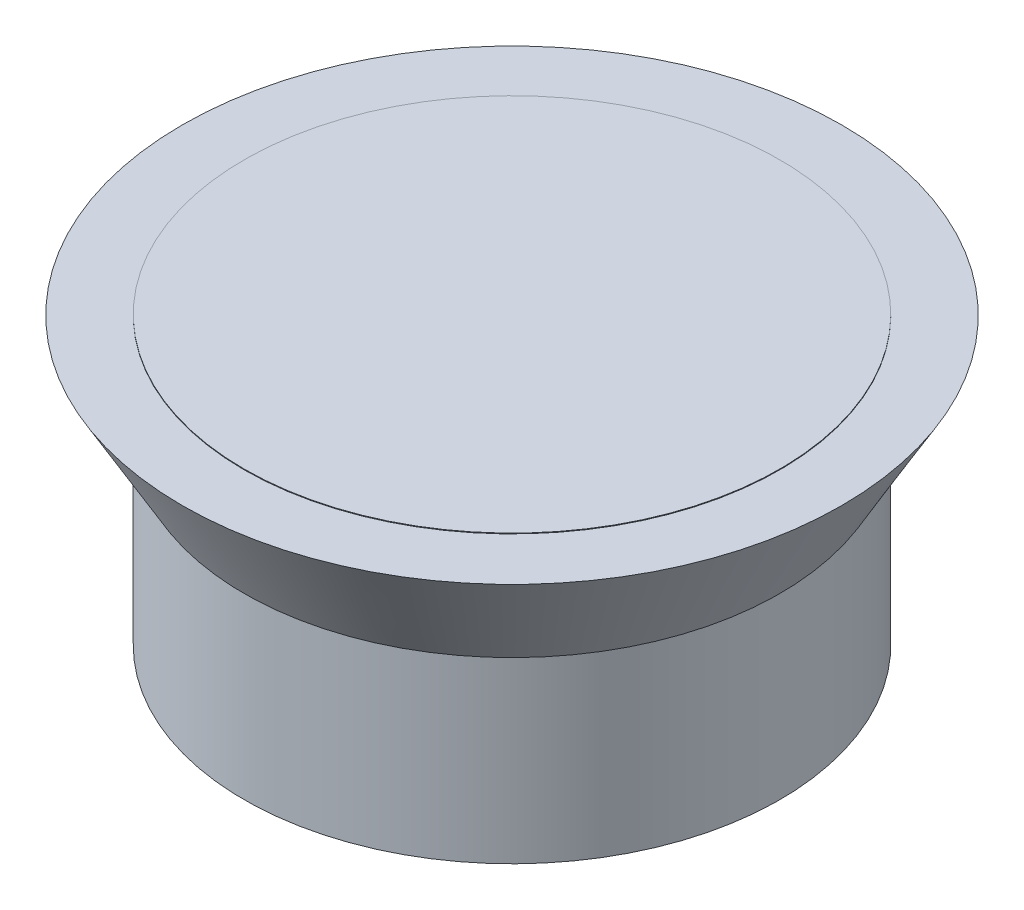
ISO-10303-21;
HEADER;
FILE_DESCRIPTION(('STEP AP214'),'2;1');
FILE_NAME('part.step','',(''),(''),'','','');
FILE_SCHEMA(('AUTOMOTIVE_DESIGN { 1 0 10303 214 1 1 1 1 }'));
ENDSEC;
DATA;
#1=APPLICATION_CONTEXT('core data for automotive mechanical design processes');
#2=APPLICATION_PROTOCOL_DEFINITION('international standard','automotive_design',2000,#1);
#3=PRODUCT_CONTEXT('',#1,'mechanical');
#4=PRODUCT('Part','Part','',(#3));
#5=PRODUCT_RELATED_PRODUCT_CATEGORY('part','',(#4));
#6=PRODUCT_DEFINITION_FORMATION('','',#4);
#7=PRODUCT_DEFINITION_CONTEXT('part definition',#1,'design');
#8=PRODUCT_DEFINITION('design','',#6,#7);
#9=PRODUCT_DEFINITION_SHAPE('','',#8);
#10=(LENGTH_UNIT() NAMED_UNIT(*) SI_UNIT(.MILLI.,.METRE.));
#11=(NAMED_UNIT(*) PLANE_ANGLE_UNIT() SI_UNIT($,.RADIAN.));
#12=(NAMED_UNIT(*) SI_UNIT($,.STERADIAN.) SOLID_ANGLE_UNIT());
#13=UNCERTAINTY_MEASURE_WITH_UNIT(LENGTH_MEASURE(1.E-05),#10,'distance_accuracy_value','');
#14=(GEOMETRIC_REPRESENTATION_CONTEXT(3) GLOBAL_UNCERTAINTY_ASSIGNED_CONTEXT((#13)) GLOBAL_UNIT_ASSIGNED_CONTEXT((#10,
#11,#12)) REPRESENTATION_CONTEXT('',''));
#15=CARTESIAN_POINT('',(0.,0.,0.));
#16=DIRECTION('',(0.,0.,1.));
#17=DIRECTION('',(1.,0.,0.));
#18=AXIS2_PLACEMENT_3D('',#15,#16,#17);
#19=CARTESIAN_POINT('',(0.,0.,0.));
#20=DIRECTION('',(0.,1.,0.));
#21=DIRECTION('',(0.,0.,1.));
#22=AXIS2_PLACEMENT_3D('',#19,#20,#21);
#23=PLANE('',#22);
#24=CARTESIAN_POINT('',(0.,0.,0.));
#25=DIRECTION('',(0.,-1.,0.));
#26=DIRECTION('',(0.,0.,-1.));
#27=AXIS2_PLACEMENT_3D('',#24,#25,#26);
#28=CIRCLE('',#27,9.525);
#29=CARTESIAN_POINT('',(0.,0.,-9.525));
#30=VERTEX_POINT('',#29);
#31=EDGE_CURVE('E38',#30,#30,#28,.T.);
#32=ORIENTED_EDGE('',*,*,#31,.T.);
#33=EDGE_LOOP('',(#32));
#34=FACE_BOUND('',#33,.T.);
#35=ADVANCED_FACE('F35',(#34),#23,.F.);
#36=CARTESIAN_POINT('',(0.,0.,0.));
#37=DIRECTION('',(0.,-1.,0.));
#38=DIRECTION('',(0.,0.,-1.));
#39=AXIS2_PLACEMENT_3D('',#36,#37,#38);
#40=CYLINDRICAL_SURFACE('',#39,9.525);
#41=ORIENTED_EDGE('',*,*,#31,.F.);
#42=EDGE_LOOP('',(#41));
#43=FACE_BOUND('',#42,.T.);
#44=CARTESIAN_POINT('',(0.,6.35,0.));
#45=DIRECTION('',(0.,-1.,0.));
#46=DIRECTION('',(0.,0.,-1.));
#47=AXIS2_PLACEMENT_3D('',#44,#45,#46);
#48=CIRCLE('',#47,9.525);
#49=CARTESIAN_POINT('',(0.,6.35,-9.525));
#50=VERTEX_POINT('',#49);
#51=EDGE_CURVE('E46',#50,#50,#48,.T.);
#52=ORIENTED_EDGE('',*,*,#51,.T.);
#53=EDGE_LOOP('',(#52));
#54=FACE_BOUND('',#53,.T.);
#55=ADVANCED_FACE('F55',(#43,#54),#40,.T.);
#56=CARTESIAN_POINT('',(0.,10.16,0.));
#57=DIRECTION('',(0.,1.,0.));
#58=DIRECTION('',(0.,0.,1.));
#59=AXIS2_PLACEMENT_3D('',#56,#57,#58);
#60=CONICAL_SURFACE('',#59,11.7247045256125,0.523598775598304);
#61=ORIENTED_EDGE('',*,*,#51,.F.);
#62=EDGE_LOOP('',(#61));
#63=FACE_BOUND('',#62,.T.);
#64=CARTESIAN_POINT('',(0.,10.16,0.));
#65=DIRECTION('',(0.,-1.,0.));
#66=DIRECTION('',(0.,0.,-1.));
#67=AXIS2_PLACEMENT_3D('',#64,#65,#66);
#68=CIRCLE('',#67,11.7247045256125);
#69=CARTESIAN_POINT('',(0.,10.16,-11.7247045256125));
#70=VERTEX_POINT('',#69);
#71=EDGE_CURVE('E50',#70,#70,#68,.T.);
#72=ORIENTED_EDGE('',*,*,#71,.T.);
#73=EDGE_LOOP('',(#72));
#74=FACE_BOUND('',#73,.T.);
#75=ADVANCED_FACE('F57',(#63,#74),#60,.T.);
#76=CARTESIAN_POINT('',(-11.7247045256125,10.16,0.));
#77=DIRECTION('',(0.,-1.,0.));
#78=DIRECTION('',(0.,0.,-1.));
#79=AXIS2_PLACEMENT_3D('',#76,#77,#78);
#80=PLANE('',#79);
#81=CARTESIAN_POINT('',(0.,10.16,0.));
#82=DIRECTION('',(0.,1.,0.));
#83=DIRECTION('',(0.,0.,1.));
#84=AXIS2_PLACEMENT_3D('',#81,#82,#83);
#85=CIRCLE('',#84,9.525);
#86=CARTESIAN_POINT('',(0.,10.16,9.525));
#87=VERTEX_POINT('',#86);
#88=EDGE_CURVE('E10',#87,#87,#85,.T.);
#89=ORIENTED_EDGE('',*,*,#88,.F.);
#90=EDGE_LOOP('',(#89));
#91=FACE_BOUND('',#90,.T.);
#92=ORIENTED_EDGE('',*,*,#71,.F.);
#93=EDGE_LOOP('',(#92));
#94=FACE_BOUND('',#93,.T.);
#95=ADVANCED_FACE('F60',(#91,#94),#80,.F.);
#96=CARTESIAN_POINT('',(0.,10.1854,0.));
#97=DIRECTION('',(0.,-1.,0.));
#98=DIRECTION('',(0.,0.,-1.));
#99=AXIS2_PLACEMENT_3D('',#96,#97,#98);
#100=CYLINDRICAL_SURFACE('',#99,9.525);
#101=CARTESIAN_POINT('',(0.,10.1854,0.));
#102=DIRECTION('',(0.,1.,0.));
#103=DIRECTION('',(0.,0.,1.));
#104=AXIS2_PLACEMENT_3D('',#101,#102,#103);
#105=CIRCLE('',#104,9.525);
#106=CARTESIAN_POINT('',(0.,10.1854,9.525));
#107=VERTEX_POINT('',#106);
#108=EDGE_CURVE('E49',#107,#107,#105,.T.);
#109=ORIENTED_EDGE('',*,*,#108,.F.);
#110=EDGE_LOOP('',(#109));
#111=FACE_BOUND('',#110,.T.);
#112=ORIENTED_EDGE('',*,*,#88,.T.);
#113=EDGE_LOOP('',(#112));
#114=FACE_BOUND('',#113,.T.);
#115=ADVANCED_FACE('F65',(#111,#114),#100,.T.);
#116=CARTESIAN_POINT('',(0.,10.1854,0.));
#117=DIRECTION('',(0.,1.,0.));
#118=DIRECTION('',(0.,0.,1.));
#119=AXIS2_PLACEMENT_3D('',#116,#117,#118);
#120=PLANE('',#119);
#121=ORIENTED_EDGE('',*,*,#108,.T.);
#122=EDGE_LOOP('',(#121));
#123=FACE_BOUND('',#122,.T.);
#124=ADVANCED_FACE('F71',(#123),#120,.T.);
#125=CLOSED_SHELL('',(#35,#55,#75,#95,#115,#124));
#126=MANIFOLD_SOLID_BREP('B2',#125);
#127=ADVANCED_BREP_SHAPE_REPRESENTATION('',(#18,#126),#14);
#128=SHAPE_DEFINITION_REPRESENTATION(#9,#127);
ENDSEC;
END-ISO-10303-21;
